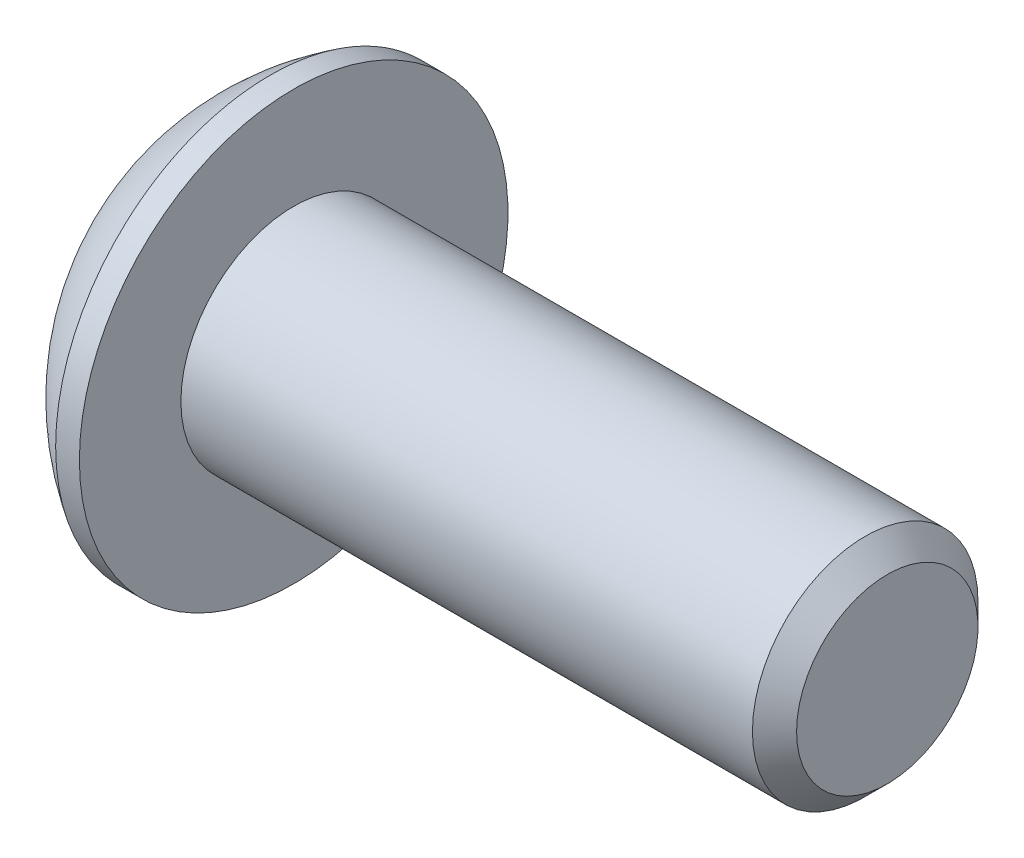
ISO-10303-21;
HEADER;
FILE_DESCRIPTION(('STEP AP214'),'2;1');
FILE_NAME('part.step','',(''),(''),'','','');
FILE_SCHEMA(('AUTOMOTIVE_DESIGN { 1 0 10303 214 1 1 1 1 }'));
ENDSEC;
DATA;
#1=APPLICATION_CONTEXT('core data for automotive mechanical design processes');
#2=APPLICATION_PROTOCOL_DEFINITION('international standard','automotive_design',2000,#1);
#3=PRODUCT_CONTEXT('',#1,'mechanical');
#4=PRODUCT('Part','Part','',(#3));
#5=PRODUCT_RELATED_PRODUCT_CATEGORY('part','',(#4));
#6=PRODUCT_DEFINITION_FORMATION('','',#4);
#7=PRODUCT_DEFINITION_CONTEXT('part definition',#1,'design');
#8=PRODUCT_DEFINITION('design','',#6,#7);
#9=PRODUCT_DEFINITION_SHAPE('','',#8);
#10=(LENGTH_UNIT() NAMED_UNIT(*) SI_UNIT(.MILLI.,.METRE.));
#11=(NAMED_UNIT(*) PLANE_ANGLE_UNIT() SI_UNIT($,.RADIAN.));
#12=(NAMED_UNIT(*) SI_UNIT($,.STERADIAN.) SOLID_ANGLE_UNIT());
#13=UNCERTAINTY_MEASURE_WITH_UNIT(LENGTH_MEASURE(1.E-05),#10,'distance_accuracy_value','');
#14=(GEOMETRIC_REPRESENTATION_CONTEXT(3) GLOBAL_UNCERTAINTY_ASSIGNED_CONTEXT((#13)) GLOBAL_UNIT_ASSIGNED_CONTEXT((#10,
#11,#12)) REPRESENTATION_CONTEXT('',''));
#15=CARTESIAN_POINT('',(0.,0.,0.));
#16=DIRECTION('',(0.,0.,1.));
#17=DIRECTION('',(1.,0.,0.));
#18=AXIS2_PLACEMENT_3D('',#15,#16,#17);
#19=CARTESIAN_POINT('',(1.77800000000017,0.,0.));
#20=DIRECTION('',(-1.,0.,0.));
#21=DIRECTION('',(0.,0.,1.));
#22=AXIS2_PLACEMENT_3D('',#19,#20,#21);
#23=CONICAL_SURFACE('',#22,1.58749999999985,1.04719755119662);
#24=CARTESIAN_POINT('',(2.69454355233856,0.,0.));
#25=VERTEX_POINT('',#24);
#26=VERTEX_LOOP('',#25);
#27=FACE_BOUND('',#26,.T.);
#28=CARTESIAN_POINT('',(1.77800000000017,0.,0.));
#29=DIRECTION('',(-1.,0.,0.));
#30=DIRECTION('',(0.,0.,1.));
#31=AXIS2_PLACEMENT_3D('',#28,#29,#30);
#32=CIRCLE('',#31,1.58749999999985);
#33=CARTESIAN_POINT('',(1.77800000000008,0.,1.58749999999993));
#34=VERTEX_POINT('',#33);
#35=CARTESIAN_POINT('',(1.77800000000008,-1.37481532850773,0.793749999999965));
#36=VERTEX_POINT('',#35);
#37=EDGE_CURVE('E19',#34,#36,#32,.F.);
#38=ORIENTED_EDGE('',*,*,#37,.F.);
#39=CARTESIAN_POINT('',(1.77800000000017,0.,0.));
#40=DIRECTION('',(-1.,0.,0.));
#41=DIRECTION('',(0.,0.,1.));
#42=AXIS2_PLACEMENT_3D('',#39,#40,#41);
#43=CIRCLE('',#42,1.58749999999985);
#44=CARTESIAN_POINT('',(1.77800000000008,1.37481532850773,0.793749999999963));
#45=VERTEX_POINT('',#44);
#46=EDGE_CURVE('E89',#34,#45,#43,.T.);
#47=ORIENTED_EDGE('',*,*,#46,.T.);
#48=CARTESIAN_POINT('',(1.77800000000017,0.,0.));
#49=DIRECTION('',(-1.,0.,0.));
#50=DIRECTION('',(0.,0.,1.));
#51=AXIS2_PLACEMENT_3D('',#48,#49,#50);
#52=CIRCLE('',#51,1.58749999999985);
#53=CARTESIAN_POINT('',(1.77800000000008,1.37481532850773,-0.793749999999963));
#54=VERTEX_POINT('',#53);
#55=EDGE_CURVE('E105',#45,#54,#52,.T.);
#56=ORIENTED_EDGE('',*,*,#55,.T.);
#57=CARTESIAN_POINT('',(1.77800000000017,0.,0.));
#58=DIRECTION('',(-1.,0.,0.));
#59=DIRECTION('',(0.,0.,1.));
#60=AXIS2_PLACEMENT_3D('',#57,#58,#59);
#61=CIRCLE('',#60,1.58749999999985);
#62=CARTESIAN_POINT('',(1.77800000000008,2.13833679173112E-12,-1.58749999999993));
#63=VERTEX_POINT('',#62);
#64=EDGE_CURVE('E448',#54,#63,#61,.T.);
#65=ORIENTED_EDGE('',*,*,#64,.T.);
#66=CARTESIAN_POINT('',(1.77800000000017,0.,0.));
#67=DIRECTION('',(-1.,0.,0.));
#68=DIRECTION('',(0.,0.,1.));
#69=AXIS2_PLACEMENT_3D('',#66,#67,#68);
#70=CIRCLE('',#69,1.58749999999985);
#71=CARTESIAN_POINT('',(1.77800000000008,-1.37481532850773,-0.793749999999965));
#72=VERTEX_POINT('',#71);
#73=EDGE_CURVE('E450',#72,#63,#70,.F.);
#74=ORIENTED_EDGE('',*,*,#73,.F.);
#75=CARTESIAN_POINT('',(1.77800000000017,0.,0.));
#76=DIRECTION('',(-1.,0.,0.));
#77=DIRECTION('',(0.,0.,1.));
#78=AXIS2_PLACEMENT_3D('',#75,#76,#77);
#79=CIRCLE('',#78,1.58749999999985);
#80=EDGE_CURVE('E92',#36,#72,#79,.F.);
#81=ORIENTED_EDGE('',*,*,#80,.F.);
#82=EDGE_LOOP('',(#38,#47,#56,#65,#74,#81));
#83=FACE_BOUND('',#82,.T.);
#84=ADVANCED_FACE('F16',(#27,#83),#23,.F.);
#85=CARTESIAN_POINT('',(1.778,-1.83308710467706,0.));
#86=DIRECTION('',(1.,0.,0.));
#87=DIRECTION('',(0.,0.,-1.));
#88=AXIS2_PLACEMENT_3D('',#85,#86,#87);
#89=PLANE('',#88);
#90=DIRECTION('',(0.,0.500000000000001,0.866025403784438));
#91=VECTOR('',#90,1.);
#92=CARTESIAN_POINT('',(1.778,-1.83308710467706,0.));
#93=LINE('',#92,#91);
#94=CARTESIAN_POINT('',(1.778,-0.91654355233853,1.5875));
#95=VERTEX_POINT('',#94);
#96=EDGE_CURVE('E110',#95,#36,#93,.F.);
#97=ORIENTED_EDGE('',*,*,#96,.F.);
#98=DIRECTION('',(0.,1.,0.));
#99=VECTOR('',#98,1.);
#100=CARTESIAN_POINT('',(1.778,-0.916543552338531,1.5875));
#101=LINE('',#100,#99);
#102=EDGE_CURVE('E108',#34,#95,#101,.F.);
#103=ORIENTED_EDGE('',*,*,#102,.F.);
#104=ORIENTED_EDGE('',*,*,#37,.T.);
#105=EDGE_LOOP('',(#97,#103,#104));
#106=FACE_BOUND('',#105,.T.);
#107=ADVANCED_FACE('F109',(#106),#89,.F.);
#108=CARTESIAN_POINT('',(1.778,-1.83308710467706,0.));
#109=DIRECTION('',(1.,0.,0.));
#110=DIRECTION('',(0.,0.,-1.));
#111=AXIS2_PLACEMENT_3D('',#108,#109,#110);
#112=PLANE('',#111);
#113=DIRECTION('',(0.,-0.500000000000001,0.866025403784438));
#114=VECTOR('',#113,1.);
#115=CARTESIAN_POINT('',(1.778,-0.916543552338531,-1.5875));
#116=LINE('',#115,#114);
#117=CARTESIAN_POINT('',(1.778,-1.83308710467706,0.));
#118=VERTEX_POINT('',#117);
#119=EDGE_CURVE('E158',#118,#72,#116,.F.);
#120=ORIENTED_EDGE('',*,*,#119,.F.);
#121=DIRECTION('',(0.,0.500000000000001,0.866025403784438));
#122=VECTOR('',#121,1.);
#123=CARTESIAN_POINT('',(1.778,-1.83308710467706,0.));
#124=LINE('',#123,#122);
#125=EDGE_CURVE('E170',#36,#118,#124,.F.);
#126=ORIENTED_EDGE('',*,*,#125,.F.);
#127=ORIENTED_EDGE('',*,*,#80,.T.);
#128=EDGE_LOOP('',(#120,#126,#127));
#129=FACE_BOUND('',#128,.T.);
#130=ADVANCED_FACE('F247',(#129),#112,.F.);
#131=CARTESIAN_POINT('',(1.778,-1.83308710467706,0.));
#132=DIRECTION('',(1.,0.,0.));
#133=DIRECTION('',(0.,0.,-1.));
#134=AXIS2_PLACEMENT_3D('',#131,#132,#133);
#135=PLANE('',#134);
#136=DIRECTION('',(0.,1.,0.));
#137=VECTOR('',#136,1.);
#138=CARTESIAN_POINT('',(1.778,0.91654355233853,-1.5875));
#139=LINE('',#138,#137);
#140=CARTESIAN_POINT('',(1.778,-0.916543552338531,-1.5875));
#141=VERTEX_POINT('',#140);
#142=EDGE_CURVE('E142',#141,#63,#139,.T.);
#143=ORIENTED_EDGE('',*,*,#142,.F.);
#144=DIRECTION('',(0.,-0.500000000000001,0.866025403784438));
#145=VECTOR('',#144,1.);
#146=CARTESIAN_POINT('',(1.778,-0.916543552338531,-1.5875));
#147=LINE('',#146,#145);
#148=EDGE_CURVE('E155',#72,#141,#147,.F.);
#149=ORIENTED_EDGE('',*,*,#148,.F.);
#150=ORIENTED_EDGE('',*,*,#73,.T.);
#151=EDGE_LOOP('',(#143,#149,#150));
#152=FACE_BOUND('',#151,.T.);
#153=ADVANCED_FACE('F243',(#152),#135,.F.);
#154=CARTESIAN_POINT('',(1.778,-1.83308710467706,0.));
#155=DIRECTION('',(1.,0.,0.));
#156=DIRECTION('',(0.,0.,-1.));
#157=AXIS2_PLACEMENT_3D('',#154,#155,#156);
#158=PLANE('',#157);
#159=DIRECTION('',(0.,-0.5,-0.866025403784439));
#160=VECTOR('',#159,1.);
#161=CARTESIAN_POINT('',(1.778,1.83308710467706,0.));
#162=LINE('',#161,#160);
#163=CARTESIAN_POINT('',(1.778,0.916543552338531,-1.5875));
#164=VERTEX_POINT('',#163);
#165=EDGE_CURVE('E127',#164,#54,#162,.F.);
#166=ORIENTED_EDGE('',*,*,#165,.F.);
#167=DIRECTION('',(0.,1.,0.));
#168=VECTOR('',#167,1.);
#169=CARTESIAN_POINT('',(1.778,0.91654355233853,-1.5875));
#170=LINE('',#169,#168);
#171=EDGE_CURVE('E139',#63,#164,#170,.T.);
#172=ORIENTED_EDGE('',*,*,#171,.F.);
#173=ORIENTED_EDGE('',*,*,#64,.F.);
#174=EDGE_LOOP('',(#166,#172,#173));
#175=FACE_BOUND('',#174,.T.);
#176=ADVANCED_FACE('F239',(#175),#158,.F.);
#177=CARTESIAN_POINT('',(1.778,-1.83308710467706,0.));
#178=DIRECTION('',(1.,0.,0.));
#179=DIRECTION('',(0.,0.,-1.));
#180=AXIS2_PLACEMENT_3D('',#177,#178,#179);
#181=PLANE('',#180);
#182=DIRECTION('',(0.,0.5,-0.866025403784439));
#183=VECTOR('',#182,1.);
#184=CARTESIAN_POINT('',(1.778,0.916543552338531,1.5875));
#185=LINE('',#184,#183);
#186=CARTESIAN_POINT('',(1.778,1.83308710467706,0.));
#187=VERTEX_POINT('',#186);
#188=EDGE_CURVE('E147',#187,#45,#185,.F.);
#189=ORIENTED_EDGE('',*,*,#188,.F.);
#190=DIRECTION('',(0.,-0.5,-0.866025403784439));
#191=VECTOR('',#190,1.);
#192=CARTESIAN_POINT('',(1.778,1.83308710467706,0.));
#193=LINE('',#192,#191);
#194=EDGE_CURVE('E124',#54,#187,#193,.F.);
#195=ORIENTED_EDGE('',*,*,#194,.F.);
#196=ORIENTED_EDGE('',*,*,#55,.F.);
#197=EDGE_LOOP('',(#189,#195,#196));
#198=FACE_BOUND('',#197,.T.);
#199=ADVANCED_FACE('F236',(#198),#181,.F.);
#200=CARTESIAN_POINT('',(1.778,-1.83308710467706,0.));
#201=DIRECTION('',(1.,0.,0.));
#202=DIRECTION('',(0.,0.,-1.));
#203=AXIS2_PLACEMENT_3D('',#200,#201,#202);
#204=PLANE('',#203);
#205=DIRECTION('',(0.,1.,0.));
#206=VECTOR('',#205,1.);
#207=CARTESIAN_POINT('',(1.778,-0.916543552338531,1.5875));
#208=LINE('',#207,#206);
#209=CARTESIAN_POINT('',(1.778,0.91654355233853,1.5875));
#210=VERTEX_POINT('',#209);
#211=EDGE_CURVE('E100',#210,#34,#208,.F.);
#212=ORIENTED_EDGE('',*,*,#211,.F.);
#213=DIRECTION('',(0.,0.5,-0.866025403784439));
#214=VECTOR('',#213,1.);
#215=CARTESIAN_POINT('',(1.778,0.916543552338531,1.5875));
#216=LINE('',#215,#214);
#217=EDGE_CURVE('E103',#45,#210,#216,.F.);
#218=ORIENTED_EDGE('',*,*,#217,.F.);
#219=ORIENTED_EDGE('',*,*,#46,.F.);
#220=EDGE_LOOP('',(#212,#218,#219));
#221=FACE_BOUND('',#220,.T.);
#222=ADVANCED_FACE('F98',(#221),#204,.F.);
#223=CARTESIAN_POINT('',(1.778,-0.916543552338531,1.5875));
#224=DIRECTION('',(0.,0.,-1.));
#225=DIRECTION('',(0.,1.,0.));
#226=AXIS2_PLACEMENT_3D('',#223,#224,#225);
#227=PLANE('',#226);
#228=DIRECTION('',(0.,1.,0.));
#229=VECTOR('',#228,1.);
#230=CARTESIAN_POINT('',(0.,0.,1.5875));
#231=LINE('',#230,#229);
#232=CARTESIAN_POINT('',(0.,0.91654355233853,1.5875));
#233=VERTEX_POINT('',#232);
#234=CARTESIAN_POINT('',(0.,-0.91654355233853,1.5875));
#235=VERTEX_POINT('',#234);
#236=EDGE_CURVE('E131',#233,#235,#231,.F.);
#237=ORIENTED_EDGE('',*,*,#236,.F.);
#238=DIRECTION('',(1.,0.,0.));
#239=VECTOR('',#238,1.);
#240=CARTESIAN_POINT('',(1.778,0.916543552338531,1.5875));
#241=LINE('',#240,#239);
#242=EDGE_CURVE('E116',#210,#233,#241,.F.);
#243=ORIENTED_EDGE('',*,*,#242,.F.);
#244=ORIENTED_EDGE('',*,*,#211,.T.);
#245=ORIENTED_EDGE('',*,*,#102,.T.);
#246=DIRECTION('',(1.,0.,0.));
#247=VECTOR('',#246,1.);
#248=CARTESIAN_POINT('',(1.778,-0.91654355233853,1.5875));
#249=LINE('',#248,#247);
#250=EDGE_CURVE('E167',#235,#95,#249,.T.);
#251=ORIENTED_EDGE('',*,*,#250,.F.);
#252=EDGE_LOOP('',(#237,#243,#244,#245,#251));
#253=FACE_BOUND('',#252,.T.);
#254=ADVANCED_FACE('F114',(#253),#227,.T.);
#255=CARTESIAN_POINT('',(1.778,-1.83308710467706,0.));
#256=DIRECTION('',(0.,0.866025403784438,-0.500000000000001));
#257=DIRECTION('',(0.,0.500000000000001,0.866025403784438));
#258=AXIS2_PLACEMENT_3D('',#255,#256,#257);
#259=PLANE('',#258);
#260=DIRECTION('',(0.,-0.500000000000001,-0.866025403784438));
#261=VECTOR('',#260,1.);
#262=CARTESIAN_POINT('',(0.,-0.916543552338531,1.5875));
#263=LINE('',#262,#261);
#264=CARTESIAN_POINT('',(0.,-1.83308710467706,0.));
#265=VERTEX_POINT('',#264);
#266=EDGE_CURVE('E434',#235,#265,#263,.T.);
#267=ORIENTED_EDGE('',*,*,#266,.F.);
#268=ORIENTED_EDGE('',*,*,#250,.T.);
#269=ORIENTED_EDGE('',*,*,#96,.T.);
#270=ORIENTED_EDGE('',*,*,#125,.T.);
#271=DIRECTION('',(1.,0.,0.));
#272=VECTOR('',#271,1.);
#273=CARTESIAN_POINT('',(1.778,-1.83308710467706,0.));
#274=LINE('',#273,#272);
#275=EDGE_CURVE('E152',#265,#118,#274,.T.);
#276=ORIENTED_EDGE('',*,*,#275,.F.);
#277=EDGE_LOOP('',(#267,#268,#269,#270,#276));
#278=FACE_BOUND('',#277,.T.);
#279=ADVANCED_FACE('F227',(#278),#259,.T.);
#280=CARTESIAN_POINT('',(1.778,-0.916543552338531,-1.5875));
#281=DIRECTION('',(0.,0.866025403784438,0.500000000000001));
#282=DIRECTION('',(0.,-0.500000000000001,0.866025403784438));
#283=AXIS2_PLACEMENT_3D('',#280,#281,#282);
#284=PLANE('',#283);
#285=DIRECTION('',(0.,0.500000000000001,-0.866025403784438));
#286=VECTOR('',#285,1.);
#287=CARTESIAN_POINT('',(0.,-1.83308710467706,0.));
#288=LINE('',#287,#286);
#289=CARTESIAN_POINT('',(0.,-0.916543552338531,-1.5875));
#290=VERTEX_POINT('',#289);
#291=EDGE_CURVE('E431',#265,#290,#288,.T.);
#292=ORIENTED_EDGE('',*,*,#291,.F.);
#293=ORIENTED_EDGE('',*,*,#275,.T.);
#294=ORIENTED_EDGE('',*,*,#119,.T.);
#295=ORIENTED_EDGE('',*,*,#148,.T.);
#296=DIRECTION('',(1.,0.,0.));
#297=VECTOR('',#296,1.);
#298=CARTESIAN_POINT('',(1.778,-0.916543552338531,-1.5875));
#299=LINE('',#298,#297);
#300=EDGE_CURVE('E136',#290,#141,#299,.T.);
#301=ORIENTED_EDGE('',*,*,#300,.F.);
#302=EDGE_LOOP('',(#292,#293,#294,#295,#301));
#303=FACE_BOUND('',#302,.T.);
#304=ADVANCED_FACE('F223',(#303),#284,.T.);
#305=CARTESIAN_POINT('',(1.778,0.91654355233853,-1.5875));
#306=DIRECTION('',(0.,0.,1.));
#307=DIRECTION('',(1.,0.,0.));
#308=AXIS2_PLACEMENT_3D('',#305,#306,#307);
#309=PLANE('',#308);
#310=DIRECTION('',(0.,1.,0.));
#311=VECTOR('',#310,1.);
#312=CARTESIAN_POINT('',(0.,0.,-1.5875));
#313=LINE('',#312,#311);
#314=CARTESIAN_POINT('',(0.,0.91654355233853,-1.5875));
#315=VERTEX_POINT('',#314);
#316=EDGE_CURVE('E428',#290,#315,#313,.T.);
#317=ORIENTED_EDGE('',*,*,#316,.F.);
#318=ORIENTED_EDGE('',*,*,#300,.T.);
#319=ORIENTED_EDGE('',*,*,#142,.T.);
#320=ORIENTED_EDGE('',*,*,#171,.T.);
#321=DIRECTION('',(1.,0.,0.));
#322=VECTOR('',#321,1.);
#323=CARTESIAN_POINT('',(1.778,0.91654355233853,-1.5875));
#324=LINE('',#323,#322);
#325=EDGE_CURVE('E126',#315,#164,#324,.T.);
#326=ORIENTED_EDGE('',*,*,#325,.F.);
#327=EDGE_LOOP('',(#317,#318,#319,#320,#326));
#328=FACE_BOUND('',#327,.T.);
#329=ADVANCED_FACE('F220',(#328),#309,.T.);
#330=CARTESIAN_POINT('',(1.778,1.83308710467706,0.));
#331=DIRECTION('',(0.,-0.866025403784439,0.5));
#332=DIRECTION('',(0.,-0.5,-0.866025403784439));
#333=AXIS2_PLACEMENT_3D('',#330,#331,#332);
#334=PLANE('',#333);
#335=DIRECTION('',(0.,0.5,0.866025403784439));
#336=VECTOR('',#335,1.);
#337=CARTESIAN_POINT('',(0.,0.91654355233853,-1.5875));
#338=LINE('',#337,#336);
#339=CARTESIAN_POINT('',(0.,1.83308710467706,0.));
#340=VERTEX_POINT('',#339);
#341=EDGE_CURVE('E425',#315,#340,#338,.T.);
#342=ORIENTED_EDGE('',*,*,#341,.F.);
#343=ORIENTED_EDGE('',*,*,#325,.T.);
#344=ORIENTED_EDGE('',*,*,#165,.T.);
#345=ORIENTED_EDGE('',*,*,#194,.T.);
#346=DIRECTION('',(1.,0.,0.));
#347=VECTOR('',#346,1.);
#348=CARTESIAN_POINT('',(1.778,1.83308710467706,0.));
#349=LINE('',#348,#347);
#350=EDGE_CURVE('E34',#340,#187,#349,.T.);
#351=ORIENTED_EDGE('',*,*,#350,.F.);
#352=EDGE_LOOP('',(#342,#343,#344,#345,#351));
#353=FACE_BOUND('',#352,.T.);
#354=ADVANCED_FACE('F216',(#353),#334,.T.);
#355=CARTESIAN_POINT('',(1.778,0.916543552338531,1.5875));
#356=DIRECTION('',(0.,-0.866025403784439,-0.5));
#357=DIRECTION('',(0.,0.5,-0.866025403784439));
#358=AXIS2_PLACEMENT_3D('',#355,#356,#357);
#359=PLANE('',#358);
#360=DIRECTION('',(0.,-0.5,0.866025403784439));
#361=VECTOR('',#360,1.);
#362=CARTESIAN_POINT('',(0.,1.83308710467706,0.));
#363=LINE('',#362,#361);
#364=EDGE_CURVE('E202',#340,#233,#363,.T.);
#365=ORIENTED_EDGE('',*,*,#364,.F.);
#366=ORIENTED_EDGE('',*,*,#350,.T.);
#367=ORIENTED_EDGE('',*,*,#188,.T.);
#368=ORIENTED_EDGE('',*,*,#217,.T.);
#369=ORIENTED_EDGE('',*,*,#242,.T.);
#370=EDGE_LOOP('',(#365,#366,#367,#368,#369));
#371=FACE_BOUND('',#370,.T.);
#372=ADVANCED_FACE('F212',(#371),#359,.T.);
#373=CARTESIAN_POINT('',(0.,0.,0.));
#374=DIRECTION('',(-1.,0.,0.));
#375=DIRECTION('',(0.,0.,1.));
#376=AXIS2_PLACEMENT_3D('',#373,#374,#375);
#377=PLANE('',#376);
#378=ORIENTED_EDGE('',*,*,#341,.T.);
#379=ORIENTED_EDGE('',*,*,#364,.T.);
#380=ORIENTED_EDGE('',*,*,#236,.T.);
#381=ORIENTED_EDGE('',*,*,#266,.T.);
#382=ORIENTED_EDGE('',*,*,#291,.T.);
#383=ORIENTED_EDGE('',*,*,#316,.T.);
#384=EDGE_LOOP('',(#378,#379,#380,#381,#382,#383));
#385=FACE_BOUND('',#384,.T.);
#386=CARTESIAN_POINT('',(0.,2.29235,0.));
#387=CARTESIAN_POINT('',(0.,2.29234961429956,0.0643619991867157));
#388=CARTESIAN_POINT('',(0.,2.28963695190107,0.128735826629365));
#389=CARTESIAN_POINT('',(0.,2.27880393843647,0.257038618985286));
#390=CARTESIAN_POINT('',(0.,2.27068199085126,0.320967446929162));
#391=CARTESIAN_POINT('',(0.,2.24906694794255,0.448021254607718));
#392=CARTESIAN_POINT('',(-2.11703149837134E-13,2.2355653265346,0.511144793381861));
#393=CARTESIAN_POINT('',(2.1187530643504E-13,2.20328400495644,0.636065176149322));
#394=CARTESIAN_POINT('',(7.91146566793156E-13,2.18450002159113,0.697860899533935));
#395=CARTESIAN_POINT('',(1.31559514040798E-12,2.12048422735802,0.880329802927749));
#396=CARTESIAN_POINT('',(0.,2.06753599079458,0.998391795928117));
#397=CARTESIAN_POINT('',(0.,1.94254204858672,1.22393765942147));
#398=CARTESIAN_POINT('',(1.09192493676844E-12,1.87049561696642,1.33142112758208));
#399=CARTESIAN_POINT('',(6.76836354300497E-13,1.7497425419488,1.48237719670935));
#400=CARTESIAN_POINT('',(1.81300934573178E-13,1.707345731323,1.53101280076738));
#401=CARTESIAN_POINT('',(-1.81126133165541E-13,1.61863910291528,1.62450601319185));
#402=CARTESIAN_POINT('',(0.,1.57233309727312,1.66936721890417));
#403=CARTESIAN_POINT('',(0.,1.47608431707233,1.7550488420402));
#404=CARTESIAN_POINT('',(0.,1.42613990458994,1.79586741981512));
#405=CARTESIAN_POINT('',(0.,1.3229945254125,1.87315615311523));
#406=CARTESIAN_POINT('',(0.,1.26979280714187,1.90962529930697));
#407=CARTESIAN_POINT('',(0.,1.10588180153951,2.01207722151089));
#408=CARTESIAN_POINT('',(0.,0.990764947001302,2.07119486286666));
#409=CARTESIAN_POINT('',(0.,0.75230219883971,2.16922858468856));
#410=CARTESIAN_POINT('',(0.,0.628956393121253,2.2081448809145));
#411=CARTESIAN_POINT('',(0.,0.377466101733263,2.2647275576592));
#412=CARTESIAN_POINT('',(0.,0.249321590440373,2.28239382469379));
#413=CARTESIAN_POINT('',(0.,-0.008114353716114,2.29595665980955));
#414=CARTESIAN_POINT('',(0.,-0.137405786579712,2.29185322789072));
#415=CARTESIAN_POINT('',(0.,-0.393449386933732,2.2620096240906));
#416=CARTESIAN_POINT('',(0.,-0.520201567981091,2.23626956775766));
#417=CARTESIAN_POINT('',(0.,-0.767645294384458,2.16383549332687));
#418=CARTESIAN_POINT('',(0.,-0.888336774993562,2.11714125142685));
#419=CARTESIAN_POINT('',(0.,-1.06210572146657,2.03247976453654));
#420=CARTESIAN_POINT('',(0.,-1.11884498714067,2.00180278323695));
#421=CARTESIAN_POINT('',(0.,-1.22954062855574,1.93578011658036));
#422=CARTESIAN_POINT('',(0.,-1.28349764565393,1.9004355139425));
#423=CARTESIAN_POINT('',(0.,-1.38821676641538,1.82534174602348));
#424=CARTESIAN_POINT('',(0.,-1.43898030563029,1.78559458231503));
#425=CARTESIAN_POINT('',(0.,-1.53701984534432,1.70193996292362));
#426=CARTESIAN_POINT('',(0.,-1.58429243280552,1.65802852924127));
#427=CARTESIAN_POINT('',(0.,-1.72023903553759,1.52059650554139));
#428=CARTESIAN_POINT('',(0.,-1.80318066138239,1.42127847626519));
#429=CARTESIAN_POINT('',(0.,-1.95118232345099,1.21011519784664));
#430=CARTESIAN_POINT('',(0.,-2.01624303935585,1.09827042509272));
#431=CARTESIAN_POINT('',(0.,-2.09907772661316,0.923538238005837));
#432=CARTESIAN_POINT('',(0.,-2.1242510306356,0.864058373981965));
#433=CARTESIAN_POINT('',(0.,-2.16947990046567,0.7432215621756));
#434=CARTESIAN_POINT('',(0.,-2.18953960800685,0.681866178863364));
#435=CARTESIAN_POINT('',(0.,-2.22438542051157,0.557786972400356));
#436=CARTESIAN_POINT('',(0.,-2.23917985294819,0.495065478128172));
#437=CARTESIAN_POINT('',(0.,-2.26343456384454,0.368611258323514));
#438=CARTESIAN_POINT('',(0.,-2.27289641559287,0.304878836759568));
#439=CARTESIAN_POINT('',(0.,-2.28388649696738,0.200873029360624));
#440=CARTESIAN_POINT('',(0.,-2.28705930623294,0.160766164180097));
#441=CARTESIAN_POINT('',(0.,-2.29129117827045,0.0804410725432709));
#442=CARTESIAN_POINT('',(0.,-2.29235024104239,0.0402228460869714));
#443=CARTESIAN_POINT('',(0.,-2.29234961429957,-0.064361999186717));
#444=CARTESIAN_POINT('',(0.,-2.28963695190109,-0.128735826629367));
#445=CARTESIAN_POINT('',(0.,-2.27880393843649,-0.257038618985288));
#446=CARTESIAN_POINT('',(0.,-2.27068199085127,-0.320967446929164));
#447=CARTESIAN_POINT('',(0.,-2.24906694794256,-0.448021254607719));
#448=CARTESIAN_POINT('',(-2.10953888396123E-13,-2.23556532653461,-0.511144793381863));
#449=CARTESIAN_POINT('',(2.11125435696053E-13,-2.20328400495644,-0.636065176149323));
#450=CARTESIAN_POINT('',(7.88346583487223E-13,-2.18450002159114,-0.697860899533937));
#451=CARTESIAN_POINT('',(1.3107899574181E-12,-2.12048422735803,-0.88032980292775));
#452=CARTESIAN_POINT('',(0.,-2.06753599079459,-0.998391795928119));
#453=CARTESIAN_POINT('',(0.,-1.94254204858673,-1.22393765942147));
#454=CARTESIAN_POINT('',(1.0896980055778E-12,-1.87049561696643,-1.33142112758208));
#455=CARTESIAN_POINT('',(6.75348057169846E-13,-1.74974254194881,-1.48237719670935));
#456=CARTESIAN_POINT('',(1.80902214372941E-13,-1.70734573132301,-1.53101280076738));
#457=CARTESIAN_POINT('',(-1.80727797391631E-13,-1.6186391029153,-1.62450601319185));
#458=CARTESIAN_POINT('',(0.,-1.57233309727313,-1.66936721890417));
#459=CARTESIAN_POINT('',(0.,-1.47608431707233,-1.7550488420402));
#460=CARTESIAN_POINT('',(0.,-1.42613990458994,-1.79586741981512));
#461=CARTESIAN_POINT('',(0.,-1.32299452541251,-1.87315615311523));
#462=CARTESIAN_POINT('',(0.,-1.26979280714188,-1.90962529930697));
#463=CARTESIAN_POINT('',(0.,-1.10588180153953,-2.0120772215109));
#464=CARTESIAN_POINT('',(0.,-0.990764947001315,-2.07119486286666));
#465=CARTESIAN_POINT('',(0.,-0.75230219883972,-2.16922858468856));
#466=CARTESIAN_POINT('',(0.,-0.628956393121263,-2.2081448809145));
#467=CARTESIAN_POINT('',(0.,-0.377466101733272,-2.2647275576592));
#468=CARTESIAN_POINT('',(0.,-0.249321590440383,-2.28239382469379));
#469=CARTESIAN_POINT('',(0.,0.00811435371610447,-2.29595665980955));
#470=CARTESIAN_POINT('',(0.,0.137405786579702,-2.29185322789072));
#471=CARTESIAN_POINT('',(0.,0.393449386933722,-2.2620096240906));
#472=CARTESIAN_POINT('',(0.,0.52020156798108,-2.23626956775766));
#473=CARTESIAN_POINT('',(0.,0.767645294384448,-2.16383549332687));
#474=CARTESIAN_POINT('',(0.,0.888336774993554,-2.11714125142685));
#475=CARTESIAN_POINT('',(0.,1.06210572146656,-2.03247976453653));
#476=CARTESIAN_POINT('',(0.,1.11884498714066,-2.00180278323695));
#477=CARTESIAN_POINT('',(0.,1.22954062855573,-1.93578011658035));
#478=CARTESIAN_POINT('',(0.,1.28349764565393,-1.9004355139425));
#479=CARTESIAN_POINT('',(0.,1.38821676641538,-1.82534174602348));
#480=CARTESIAN_POINT('',(0.,1.43898030563029,-1.78559458231503));
#481=CARTESIAN_POINT('',(0.,1.53701984534431,-1.70193996292361));
#482=CARTESIAN_POINT('',(0.,1.58429243280551,-1.65802852924127));
#483=CARTESIAN_POINT('',(0.,1.72023903553758,-1.52059650554139));
#484=CARTESIAN_POINT('',(0.,1.80318066138239,-1.42127847626519));
#485=CARTESIAN_POINT('',(0.,1.95118232345098,-1.21011519784663));
#486=CARTESIAN_POINT('',(0.,2.01624303935584,-1.09827042509272));
#487=CARTESIAN_POINT('',(0.,2.09907772661314,-0.923538238005834));
#488=CARTESIAN_POINT('',(0.,2.12425103063559,-0.864058373981962));
#489=CARTESIAN_POINT('',(0.,2.16947990046565,-0.743221562175597));
#490=CARTESIAN_POINT('',(0.,2.18953960800684,-0.681866178863361));
#491=CARTESIAN_POINT('',(0.,2.22438542051156,-0.557786972400352));
#492=CARTESIAN_POINT('',(0.,2.23917985294818,-0.495065478128168));
#493=CARTESIAN_POINT('',(0.,2.26343456384453,-0.368611258323511));
#494=CARTESIAN_POINT('',(0.,2.27289641559285,-0.304878836759565));
#495=CARTESIAN_POINT('',(0.,2.28388649696736,-0.200873029360621));
#496=CARTESIAN_POINT('',(0.,2.28705930623293,-0.160766164180095));
#497=CARTESIAN_POINT('',(0.,2.29129117827044,-0.0804410725432707));
#498=CARTESIAN_POINT('',(0.,2.29235024104238,-0.0402228460869719));
#499=CARTESIAN_POINT('',(0.,2.29235,0.));
#500=B_SPLINE_CURVE_WITH_KNOTS('',3,(#386,#387,#388,#389,#390,#391,#392,#393,#394,#395,#396,
#397,#398,#399,#400,#401,#402,#403,#404,#405,#406,#407,#408,#409,#410,#411,#412,#413,#414,#415,
#416,#417,#418,#419,#420,#421,#422,#423,#424,#425,#426,#427,#428,#429,#430,#431,#432,#433,#434,
#435,#436,#437,#438,#439,#440,#441,#442,#443,#444,#445,#446,#447,#448,#449,#450,#451,#452,#453,
#454,#455,#456,#457,#458,#459,#460,#461,#462,#463,#464,#465,#466,#467,#468,#469,#470,#471,#472,
#473,#474,#475,#476,#477,#478,#479,#480,#481,#482,#483,#484,#485,#486,#487,#488,#489,#490,#491,
#492,#493,#494,#495,#496,#497,#498,#499),.UNSPECIFIED.,.T.,.F.,(4,2,2,2,2,2,2,2,2,2,2,2,2,2,2,2,
2,2,2,2,2,2,2,2,2,2,2,2,2,2,2,2,2,2,2,2,2,2,2,2,2,2,2,2,2,2,2,2,2,2,2,2,2,2,2,2,4),(0.,
0.193048968618033,0.386154939782395,0.579568183995959,0.773138711491039,1.15935703864578,
1.54559004914645,1.73895960916368,1.93214273180063,2.12541336477222,2.31872876140889,
2.70495649282619,3.09118009906583,3.47740576789432,3.86363143672285,4.24985504296254,
4.63608277437979,4.8293981710162,5.02266880398748,5.2158519266242,5.40922148664122,
5.79545449714217,6.18167282429725,6.37524335179262,6.56865659600642,6.76176256717089,
6.95481153578908,7.07545693291922,7.19610233004937,7.3891512986674,7.58225726983177,
7.77567051404533,7.96924104154041,8.35545936869515,8.74169237919582,8.93506193921306,
9.12824506185001,9.32151569482159,9.51483109145826,9.90105882287556,10.2872824291152,
10.6735080979437,11.0597337667722,11.4459573730119,11.8321851044292,12.0255005010656,
12.2187711340369,12.4119542566736,12.6053238166906,12.9915568271915,13.3777751543466,
13.571345681842,13.7647589260558,13.9578648972203,14.1509138658385,14.2715592629686,
14.3922046600987),.UNSPECIFIED.);
#501=CARTESIAN_POINT('',(0.,2.29235,0.));
#502=VERTEX_POINT('',#501);
#503=EDGE_CURVE('E196',#502,#502,#500,.T.);
#504=ORIENTED_EDGE('',*,*,#503,.F.);
#505=EDGE_LOOP('',(#504));
#506=FACE_BOUND('',#505,.T.);
#507=ADVANCED_FACE('F208',(#385,#506),#377,.T.);
#508=CARTESIAN_POINT('',(4.85989606481482,0.,0.));
#509=DIRECTION('',(0.,1.,0.));
#510=DIRECTION('',(1.,0.,0.));
#511=AXIS2_PLACEMENT_3D('',#508,#509,#510);
#512=SPHERICAL_SURFACE('',#511,5.37340285883188);
#513=CARTESIAN_POINT('',(2.0574,0.,0.));
#514=DIRECTION('',(-1.,0.,0.));
#515=DIRECTION('',(0.,0.,1.));
#516=AXIS2_PLACEMENT_3D('',#513,#514,#515);
#517=CIRCLE('',#516,4.5847);
#518=CARTESIAN_POINT('',(2.0574,0.,4.5847));
#519=VERTEX_POINT('',#518);
#520=EDGE_CURVE('E193',#519,#519,#517,.F.);
#521=ORIENTED_EDGE('',*,*,#520,.F.);
#522=EDGE_LOOP('',(#521));
#523=FACE_BOUND('',#522,.T.);
#524=ORIENTED_EDGE('',*,*,#503,.T.);
#525=EDGE_LOOP('',(#524));
#526=FACE_BOUND('',#525,.T.);
#527=ADVANCED_FACE('F204',(#523,#526),#512,.T.);
#528=CARTESIAN_POINT('',(15.2654,0.,0.));
#529=DIRECTION('',(-1.,0.,0.));
#530=DIRECTION('',(0.,0.,1.));
#531=AXIS2_PLACEMENT_3D('',#528,#529,#530);
#532=PLANE('',#531);
#533=CARTESIAN_POINT('',(15.2654000000325,0.,0.));
#534=DIRECTION('',(-1.,0.,0.));
#535=DIRECTION('',(0.,0.,1.));
#536=AXIS2_PLACEMENT_3D('',#533,#534,#535);
#537=CIRCLE('',#536,1.94055999992315);
#538=CARTESIAN_POINT('',(15.2654000000325,0.,1.94055999992315));
#539=VERTEX_POINT('',#538);
#540=EDGE_CURVE('E190',#539,#539,#537,.T.);
#541=ORIENTED_EDGE('',*,*,#540,.F.);
#542=EDGE_LOOP('',(#541));
#543=FACE_BOUND('',#542,.T.);
#544=ADVANCED_FACE('F275',(#543),#532,.F.);
#545=CARTESIAN_POINT('',(0.,0.,0.));
#546=DIRECTION('',(-1.,0.,0.));
#547=DIRECTION('',(0.,0.,1.));
#548=AXIS2_PLACEMENT_3D('',#545,#546,#547);
#549=CYLINDRICAL_SURFACE('',#548,4.5847);
#550=ORIENTED_EDGE('',*,*,#520,.T.);
#551=EDGE_LOOP('',(#550));
#552=FACE_BOUND('',#551,.T.);
#553=CARTESIAN_POINT('',(2.5654,0.,0.));
#554=DIRECTION('',(-1.,0.,0.));
#555=DIRECTION('',(0.,0.,1.));
#556=AXIS2_PLACEMENT_3D('',#553,#554,#555);
#557=CIRCLE('',#556,4.5847);
#558=CARTESIAN_POINT('',(2.5654,0.,4.5847));
#559=VERTEX_POINT('',#558);
#560=EDGE_CURVE('E187',#559,#559,#557,.T.);
#561=ORIENTED_EDGE('',*,*,#560,.T.);
#562=EDGE_LOOP('',(#561));
#563=FACE_BOUND('',#562,.T.);
#564=ADVANCED_FACE('F272',(#552,#563),#549,.T.);
#565=CARTESIAN_POINT('',(14.7929600000793,0.,0.));
#566=DIRECTION('',(-1.,0.,0.));
#567=DIRECTION('',(0.,0.,1.));
#568=AXIS2_PLACEMENT_3D('',#565,#566,#567);
#569=CONICAL_SURFACE('',#568,2.41299999987632,0.785398163397448);
#570=CARTESIAN_POINT('',(14.79296,0.,0.));
#571=DIRECTION('',(-1.,0.,0.));
#572=DIRECTION('',(0.,0.,1.));
#573=AXIS2_PLACEMENT_3D('',#570,#571,#572);
#574=CIRCLE('',#573,2.41299999999999);
#575=CARTESIAN_POINT('',(14.79296,0.,2.41299999999999));
#576=VERTEX_POINT('',#575);
#577=EDGE_CURVE('E25',#576,#576,#574,.T.);
#578=ORIENTED_EDGE('',*,*,#577,.F.);
#579=EDGE_LOOP('',(#578));
#580=FACE_BOUND('',#579,.T.);
#581=ORIENTED_EDGE('',*,*,#540,.T.);
#582=EDGE_LOOP('',(#581));
#583=FACE_BOUND('',#582,.T.);
#584=ADVANCED_FACE('F265',(#580,#583),#569,.T.);
#585=CARTESIAN_POINT('',(2.5654,2.41299999999999,0.));
#586=DIRECTION('',(-1.,0.,0.));
#587=DIRECTION('',(0.,0.,1.));
#588=AXIS2_PLACEMENT_3D('',#585,#586,#587);
#589=PLANE('',#588);
#590=CARTESIAN_POINT('',(2.5654,0.,0.));
#591=DIRECTION('',(-1.,0.,0.));
#592=DIRECTION('',(0.,0.,1.));
#593=AXIS2_PLACEMENT_3D('',#590,#591,#592);
#594=CIRCLE('',#593,2.41299999999999);
#595=CARTESIAN_POINT('',(2.5654,0.,2.41299999999999));
#596=VERTEX_POINT('',#595);
#597=EDGE_CURVE('E11',#596,#596,#594,.F.);
#598=ORIENTED_EDGE('',*,*,#597,.F.);
#599=EDGE_LOOP('',(#598));
#600=FACE_BOUND('',#599,.T.);
#601=ORIENTED_EDGE('',*,*,#560,.F.);
#602=EDGE_LOOP('',(#601));
#603=FACE_BOUND('',#602,.T.);
#604=ADVANCED_FACE('F259',(#600,#603),#589,.F.);
#605=CARTESIAN_POINT('',(0.,0.,0.));
#606=DIRECTION('',(-1.,0.,0.));
#607=DIRECTION('',(0.,0.,1.));
#608=AXIS2_PLACEMENT_3D('',#605,#606,#607);
#609=CYLINDRICAL_SURFACE('',#608,2.41299999999999);
#610=ORIENTED_EDGE('',*,*,#597,.T.);
#611=EDGE_LOOP('',(#610));
#612=FACE_BOUND('',#611,.T.);
#613=ORIENTED_EDGE('',*,*,#577,.T.);
#614=EDGE_LOOP('',(#613));
#615=FACE_BOUND('',#614,.T.);
#616=ADVANCED_FACE('F257',(#612,#615),#609,.T.);
#617=CLOSED_SHELL('',(#84,#107,#130,#153,#176,#199,#222,#254,#279,#304,#329,#354,#372,#507,#527,
#544,#564,#584,#604,#616));
#618=MANIFOLD_SOLID_BREP('B1',#617);
#619=ADVANCED_BREP_SHAPE_REPRESENTATION('',(#18,#618),#14);
#620=SHAPE_DEFINITION_REPRESENTATION(#9,#619);
ENDSEC;
END-ISO-10303-21;
